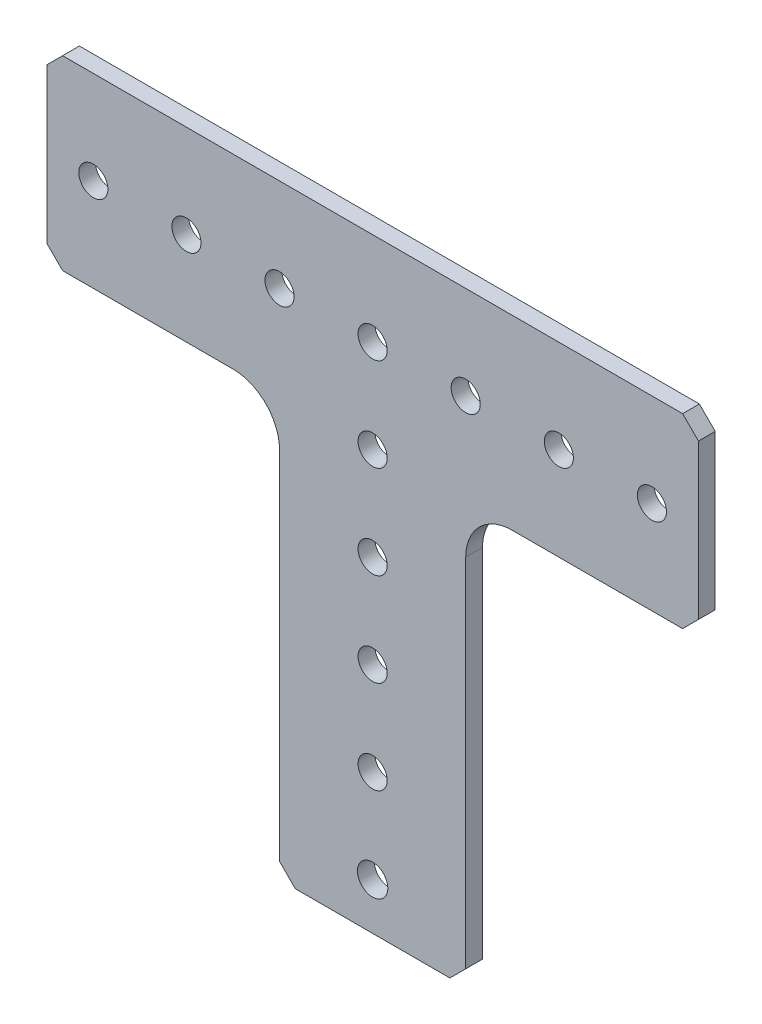
ISO-10303-21;
HEADER;
FILE_DESCRIPTION(('STEP AP214'),'2;1');
FILE_NAME('part.step','',(''),(''),'','','');
FILE_SCHEMA(('AUTOMOTIVE_DESIGN { 1 0 10303 214 1 1 1 1 }'));
ENDSEC;
DATA;
#1=APPLICATION_CONTEXT('core data for automotive mechanical design processes');
#2=APPLICATION_PROTOCOL_DEFINITION('international standard','automotive_design',2000,#1);
#3=PRODUCT_CONTEXT('',#1,'mechanical');
#4=PRODUCT('Part','Part','',(#3));
#5=PRODUCT_RELATED_PRODUCT_CATEGORY('part','',(#4));
#6=PRODUCT_DEFINITION_FORMATION('','',#4);
#7=PRODUCT_DEFINITION_CONTEXT('part definition',#1,'design');
#8=PRODUCT_DEFINITION('design','',#6,#7);
#9=PRODUCT_DEFINITION_SHAPE('','',#8);
#10=(LENGTH_UNIT() NAMED_UNIT(*) SI_UNIT(.MILLI.,.METRE.));
#11=(NAMED_UNIT(*) PLANE_ANGLE_UNIT() SI_UNIT($,.RADIAN.));
#12=(NAMED_UNIT(*) SI_UNIT($,.STERADIAN.) SOLID_ANGLE_UNIT());
#13=UNCERTAINTY_MEASURE_WITH_UNIT(LENGTH_MEASURE(1.E-05),#10,'distance_accuracy_value','');
#14=(GEOMETRIC_REPRESENTATION_CONTEXT(3) GLOBAL_UNCERTAINTY_ASSIGNED_CONTEXT((#13)) GLOBAL_UNIT_ASSIGNED_CONTEXT((#10,
#11,#12)) REPRESENTATION_CONTEXT('',''));
#15=CARTESIAN_POINT('',(0.,0.,0.));
#16=DIRECTION('',(0.,0.,1.));
#17=DIRECTION('',(1.,0.,0.));
#18=AXIS2_PLACEMENT_3D('',#15,#16,#17);
#19=CARTESIAN_POINT('',(19.05,-6.34999999999998,0.));
#20=DIRECTION('',(0.,0.,-1.));
#21=DIRECTION('',(-1.,0.,0.));
#22=AXIS2_PLACEMENT_3D('',#19,#20,#21);
#23=PLANE('',#22);
#24=CARTESIAN_POINT('',(-38.1,12.7,0.));
#25=DIRECTION('',(0.,0.,1.));
#26=DIRECTION('',(1.,0.,0.));
#27=AXIS2_PLACEMENT_3D('',#24,#25,#26);
#28=CIRCLE('',#27,1.984375);
#29=CARTESIAN_POINT('',(-36.115625,12.7,0.));
#30=VERTEX_POINT('',#29);
#31=EDGE_CURVE('E568',#30,#30,#28,.T.);
#32=ORIENTED_EDGE('',*,*,#31,.T.);
#33=EDGE_LOOP('',(#32));
#34=FACE_BOUND('',#33,.T.);
#35=CARTESIAN_POINT('',(-25.4,12.7,0.));
#36=DIRECTION('',(0.,0.,1.));
#37=DIRECTION('',(1.,0.,0.));
#38=AXIS2_PLACEMENT_3D('',#35,#36,#37);
#39=CIRCLE('',#38,1.984375);
#40=CARTESIAN_POINT('',(-23.415625,12.7,0.));
#41=VERTEX_POINT('',#40);
#42=EDGE_CURVE('E573',#41,#41,#39,.T.);
#43=ORIENTED_EDGE('',*,*,#42,.T.);
#44=EDGE_LOOP('',(#43));
#45=FACE_BOUND('',#44,.T.);
#46=CARTESIAN_POINT('',(-12.7,12.7,0.));
#47=DIRECTION('',(0.,0.,1.));
#48=DIRECTION('',(1.,0.,0.));
#49=AXIS2_PLACEMENT_3D('',#46,#47,#48);
#50=CIRCLE('',#49,1.984375);
#51=CARTESIAN_POINT('',(-10.715625,12.7,0.));
#52=VERTEX_POINT('',#51);
#53=EDGE_CURVE('E577',#52,#52,#50,.T.);
#54=ORIENTED_EDGE('',*,*,#53,.T.);
#55=EDGE_LOOP('',(#54));
#56=FACE_BOUND('',#55,.T.);
#57=CARTESIAN_POINT('',(0.,12.7,0.));
#58=DIRECTION('',(0.,0.,1.));
#59=DIRECTION('',(1.,0.,0.));
#60=AXIS2_PLACEMENT_3D('',#57,#58,#59);
#61=CIRCLE('',#60,1.984375);
#62=CARTESIAN_POINT('',(1.984375,12.7,0.));
#63=VERTEX_POINT('',#62);
#64=EDGE_CURVE('E581',#63,#63,#61,.T.);
#65=ORIENTED_EDGE('',*,*,#64,.T.);
#66=EDGE_LOOP('',(#65));
#67=FACE_BOUND('',#66,.T.);
#68=CARTESIAN_POINT('',(12.7,12.7,0.));
#69=DIRECTION('',(0.,0.,1.));
#70=DIRECTION('',(1.,0.,0.));
#71=AXIS2_PLACEMENT_3D('',#68,#69,#70);
#72=CIRCLE('',#71,1.984375);
#73=CARTESIAN_POINT('',(14.684375,12.7,0.));
#74=VERTEX_POINT('',#73);
#75=EDGE_CURVE('E585',#74,#74,#72,.T.);
#76=ORIENTED_EDGE('',*,*,#75,.T.);
#77=EDGE_LOOP('',(#76));
#78=FACE_BOUND('',#77,.T.);
#79=CARTESIAN_POINT('',(25.4,12.7,0.));
#80=DIRECTION('',(0.,0.,1.));
#81=DIRECTION('',(1.,0.,0.));
#82=AXIS2_PLACEMENT_3D('',#79,#80,#81);
#83=CIRCLE('',#82,1.984375);
#84=CARTESIAN_POINT('',(27.384375,12.7,0.));
#85=VERTEX_POINT('',#84);
#86=EDGE_CURVE('E589',#85,#85,#83,.T.);
#87=ORIENTED_EDGE('',*,*,#86,.T.);
#88=EDGE_LOOP('',(#87));
#89=FACE_BOUND('',#88,.T.);
#90=CARTESIAN_POINT('',(38.1,12.7,0.));
#91=DIRECTION('',(0.,0.,1.));
#92=DIRECTION('',(1.,0.,0.));
#93=AXIS2_PLACEMENT_3D('',#90,#91,#92);
#94=CIRCLE('',#93,1.984375);
#95=CARTESIAN_POINT('',(40.084375,12.7,0.));
#96=VERTEX_POINT('',#95);
#97=EDGE_CURVE('E593',#96,#96,#94,.T.);
#98=ORIENTED_EDGE('',*,*,#97,.T.);
#99=EDGE_LOOP('',(#98));
#100=FACE_BOUND('',#99,.T.);
#101=CARTESIAN_POINT('',(0.,0.,0.));
#102=DIRECTION('',(0.,0.,1.));
#103=DIRECTION('',(1.,0.,0.));
#104=AXIS2_PLACEMENT_3D('',#101,#102,#103);
#105=CIRCLE('',#104,1.984375);
#106=CARTESIAN_POINT('',(1.984375,0.,0.));
#107=VERTEX_POINT('',#106);
#108=EDGE_CURVE('E597',#107,#107,#105,.T.);
#109=ORIENTED_EDGE('',*,*,#108,.T.);
#110=EDGE_LOOP('',(#109));
#111=FACE_BOUND('',#110,.T.);
#112=CARTESIAN_POINT('',(0.,-12.7,0.));
#113=DIRECTION('',(0.,0.,1.));
#114=DIRECTION('',(1.,0.,0.));
#115=AXIS2_PLACEMENT_3D('',#112,#113,#114);
#116=CIRCLE('',#115,1.984375);
#117=CARTESIAN_POINT('',(1.984375,-12.7,0.));
#118=VERTEX_POINT('',#117);
#119=EDGE_CURVE('E601',#118,#118,#116,.T.);
#120=ORIENTED_EDGE('',*,*,#119,.T.);
#121=EDGE_LOOP('',(#120));
#122=FACE_BOUND('',#121,.T.);
#123=CARTESIAN_POINT('',(0.,-25.4,0.));
#124=DIRECTION('',(0.,0.,1.));
#125=DIRECTION('',(1.,0.,0.));
#126=AXIS2_PLACEMENT_3D('',#123,#124,#125);
#127=CIRCLE('',#126,1.984375);
#128=CARTESIAN_POINT('',(1.984375,-25.4,0.));
#129=VERTEX_POINT('',#128);
#130=EDGE_CURVE('E605',#129,#129,#127,.T.);
#131=ORIENTED_EDGE('',*,*,#130,.T.);
#132=EDGE_LOOP('',(#131));
#133=FACE_BOUND('',#132,.T.);
#134=DIRECTION('',(0.707106781186547,0.707106781186548,0.));
#135=VECTOR('',#134,1.);
#136=CARTESIAN_POINT('',(10.541,-57.15,0.));
#137=LINE('',#136,#135);
#138=CARTESIAN_POINT('',(10.541,-57.15,0.));
#139=VERTEX_POINT('',#138);
#140=CARTESIAN_POINT('',(12.7,-54.991,0.));
#141=VERTEX_POINT('',#140);
#142=EDGE_CURVE('E224',#139,#141,#137,.T.);
#143=ORIENTED_EDGE('',*,*,#142,.F.);
#144=DIRECTION('',(1.,0.,0.));
#145=VECTOR('',#144,1.);
#146=CARTESIAN_POINT('',(-10.541,-57.15,0.));
#147=LINE('',#146,#145);
#148=CARTESIAN_POINT('',(-10.541,-57.15,0.));
#149=VERTEX_POINT('',#148);
#150=EDGE_CURVE('E169',#149,#139,#147,.T.);
#151=ORIENTED_EDGE('',*,*,#150,.F.);
#152=DIRECTION('',(0.70710678118655,-0.707106781186545,0.));
#153=VECTOR('',#152,1.);
#154=CARTESIAN_POINT('',(-12.7,-54.991,0.));
#155=LINE('',#154,#153);
#156=CARTESIAN_POINT('',(-12.7,-54.991,0.));
#157=VERTEX_POINT('',#156);
#158=EDGE_CURVE('E154',#157,#149,#155,.T.);
#159=ORIENTED_EDGE('',*,*,#158,.F.);
#160=DIRECTION('',(0.,-1.,0.));
#161=VECTOR('',#160,1.);
#162=CARTESIAN_POINT('',(-12.7,-6.34999999999998,0.));
#163=LINE('',#162,#161);
#164=CARTESIAN_POINT('',(-12.7,-6.34999999999999,0.));
#165=VERTEX_POINT('',#164);
#166=EDGE_CURVE('E167',#165,#157,#163,.T.);
#167=ORIENTED_EDGE('',*,*,#166,.F.);
#168=CARTESIAN_POINT('',(-19.05,-6.34999999999999,0.));
#169=DIRECTION('',(0.,0.,-1.));
#170=DIRECTION('',(-1.,0.,0.));
#171=AXIS2_PLACEMENT_3D('',#168,#169,#170);
#172=CIRCLE('',#171,6.35);
#173=CARTESIAN_POINT('',(-19.05,0.,0.));
#174=VERTEX_POINT('',#173);
#175=EDGE_CURVE('E172',#174,#165,#172,.T.);
#176=ORIENTED_EDGE('',*,*,#175,.F.);
#177=DIRECTION('',(1.,0.,0.));
#178=VECTOR('',#177,1.);
#179=CARTESIAN_POINT('',(-42.291,0.,0.));
#180=LINE('',#179,#178);
#181=CARTESIAN_POINT('',(-42.291,0.,0.));
#182=VERTEX_POINT('',#181);
#183=EDGE_CURVE('E174',#182,#174,#180,.T.);
#184=ORIENTED_EDGE('',*,*,#183,.F.);
#185=DIRECTION('',(0.70710678118655,-0.707106781186545,0.));
#186=VECTOR('',#185,1.);
#187=CARTESIAN_POINT('',(-44.45,2.15899999999999,0.));
#188=LINE('',#187,#186);
#189=CARTESIAN_POINT('',(-44.45,2.15899999999999,0.));
#190=VERTEX_POINT('',#189);
#191=EDGE_CURVE('E362',#190,#182,#188,.T.);
#192=ORIENTED_EDGE('',*,*,#191,.F.);
#193=DIRECTION('',(0.,-1.,0.));
#194=VECTOR('',#193,1.);
#195=CARTESIAN_POINT('',(-44.45,23.241,0.));
#196=LINE('',#195,#194);
#197=CARTESIAN_POINT('',(-44.45,23.241,0.));
#198=VERTEX_POINT('',#197);
#199=EDGE_CURVE('E359',#198,#190,#196,.T.);
#200=ORIENTED_EDGE('',*,*,#199,.F.);
#201=DIRECTION('',(-0.707106781186552,-0.707106781186543,0.));
#202=VECTOR('',#201,1.);
#203=CARTESIAN_POINT('',(-42.291,25.4,0.));
#204=LINE('',#203,#202);
#205=CARTESIAN_POINT('',(-42.291,25.4,0.));
#206=VERTEX_POINT('',#205);
#207=EDGE_CURVE('E356',#206,#198,#204,.T.);
#208=ORIENTED_EDGE('',*,*,#207,.F.);
#209=DIRECTION('',(-1.,0.,0.));
#210=VECTOR('',#209,1.);
#211=CARTESIAN_POINT('',(42.291,25.4,0.));
#212=LINE('',#211,#210);
#213=CARTESIAN_POINT('',(42.291,25.4,0.));
#214=VERTEX_POINT('',#213);
#215=EDGE_CURVE('E353',#214,#206,#212,.T.);
#216=ORIENTED_EDGE('',*,*,#215,.F.);
#217=DIRECTION('',(-0.707106781186549,0.707106781186546,0.));
#218=VECTOR('',#217,1.);
#219=CARTESIAN_POINT('',(44.45,23.241,0.));
#220=LINE('',#219,#218);
#221=CARTESIAN_POINT('',(44.45,23.241,0.));
#222=VERTEX_POINT('',#221);
#223=EDGE_CURVE('E350',#222,#214,#220,.T.);
#224=ORIENTED_EDGE('',*,*,#223,.F.);
#225=DIRECTION('',(0.,1.,0.));
#226=VECTOR('',#225,1.);
#227=CARTESIAN_POINT('',(44.45,2.15900000000002,0.));
#228=LINE('',#227,#226);
#229=CARTESIAN_POINT('',(44.45,2.15900000000002,0.));
#230=VERTEX_POINT('',#229);
#231=EDGE_CURVE('E347',#230,#222,#228,.T.);
#232=ORIENTED_EDGE('',*,*,#231,.F.);
#233=DIRECTION('',(0.707106781186546,0.707106781186548,0.));
#234=VECTOR('',#233,1.);
#235=CARTESIAN_POINT('',(42.291,0.,0.));
#236=LINE('',#235,#234);
#237=CARTESIAN_POINT('',(42.291,0.,0.));
#238=VERTEX_POINT('',#237);
#239=EDGE_CURVE('E344',#238,#230,#236,.T.);
#240=ORIENTED_EDGE('',*,*,#239,.F.);
#241=DIRECTION('',(1.,0.,0.));
#242=VECTOR('',#241,1.);
#243=CARTESIAN_POINT('',(19.05,0.,0.));
#244=LINE('',#243,#242);
#245=CARTESIAN_POINT('',(19.05,0.,0.));
#246=VERTEX_POINT('',#245);
#247=EDGE_CURVE('E341',#246,#238,#244,.T.);
#248=ORIENTED_EDGE('',*,*,#247,.F.);
#249=CARTESIAN_POINT('',(19.05,-6.34999999999998,0.));
#250=DIRECTION('',(0.,0.,-1.));
#251=DIRECTION('',(-1.,0.,0.));
#252=AXIS2_PLACEMENT_3D('',#249,#250,#251);
#253=CIRCLE('',#252,6.35);
#254=CARTESIAN_POINT('',(12.7,-6.34999999999998,0.));
#255=VERTEX_POINT('',#254);
#256=EDGE_CURVE('E338',#255,#246,#253,.T.);
#257=ORIENTED_EDGE('',*,*,#256,.F.);
#258=DIRECTION('',(0.,1.,0.));
#259=VECTOR('',#258,1.);
#260=CARTESIAN_POINT('',(12.7,-54.991,0.));
#261=LINE('',#260,#259);
#262=EDGE_CURVE('E336',#141,#255,#261,.T.);
#263=ORIENTED_EDGE('',*,*,#262,.F.);
#264=EDGE_LOOP('',(#143,#151,#159,#167,#176,#184,#192,#200,#208,#216,#224,#232,#240,#248,#257,#263));
#265=FACE_BOUND('',#264,.T.);
#266=CARTESIAN_POINT('',(0.,-50.8,0.));
#267=DIRECTION('',(0.,0.,1.));
#268=DIRECTION('',(-1.,0.,0.));
#269=AXIS2_PLACEMENT_3D('',#266,#267,#268);
#270=CIRCLE('',#269,2.0701);
#271=CARTESIAN_POINT('',(-2.07009999999999,-50.8,0.));
#272=VERTEX_POINT('',#271);
#273=EDGE_CURVE('E183',#272,#272,#270,.T.);
#274=ORIENTED_EDGE('',*,*,#273,.T.);
#275=EDGE_LOOP('',(#274));
#276=FACE_BOUND('',#275,.T.);
#277=CARTESIAN_POINT('',(0.,-38.1,0.));
#278=DIRECTION('',(0.,0.,1.));
#279=DIRECTION('',(1.,0.,0.));
#280=AXIS2_PLACEMENT_3D('',#277,#278,#279);
#281=CIRCLE('',#280,1.984375);
#282=CARTESIAN_POINT('',(1.984375,-38.1,0.));
#283=VERTEX_POINT('',#282);
#284=EDGE_CURVE('E328',#283,#283,#281,.T.);
#285=ORIENTED_EDGE('',*,*,#284,.T.);
#286=EDGE_LOOP('',(#285));
#287=FACE_BOUND('',#286,.T.);
#288=ADVANCED_FACE('F33',(#34,#45,#56,#67,#78,#89,#100,#111,#122,#133,#265,#276,#287),#23,.T.);
#289=CARTESIAN_POINT('',(10.541,-57.15,0.));
#290=DIRECTION('',(0.707106781186548,-0.707106781186547,0.));
#291=DIRECTION('',(0.707106781186547,0.707106781186548,0.));
#292=AXIS2_PLACEMENT_3D('',#289,#290,#291);
#293=PLANE('',#292);
#294=DIRECTION('',(0.707106781186547,0.707106781186548,0.));
#295=VECTOR('',#294,1.);
#296=CARTESIAN_POINT('',(10.541,-57.15,2.286));
#297=LINE('',#296,#295);
#298=CARTESIAN_POINT('',(10.541,-57.15,2.286));
#299=VERTEX_POINT('',#298);
#300=CARTESIAN_POINT('',(12.7,-54.991,2.286));
#301=VERTEX_POINT('',#300);
#302=EDGE_CURVE('E179',#299,#301,#297,.T.);
#303=ORIENTED_EDGE('',*,*,#302,.F.);
#304=DIRECTION('',(0.,0.,1.));
#305=VECTOR('',#304,1.);
#306=CARTESIAN_POINT('',(10.541,-57.15,0.));
#307=LINE('',#306,#305);
#308=EDGE_CURVE('E11',#139,#299,#307,.T.);
#309=ORIENTED_EDGE('',*,*,#308,.F.);
#310=ORIENTED_EDGE('',*,*,#142,.T.);
#311=DIRECTION('',(0.,0.,1.));
#312=VECTOR('',#311,1.);
#313=CARTESIAN_POINT('',(12.7,-54.991,0.));
#314=LINE('',#313,#312);
#315=EDGE_CURVE('E37',#141,#301,#314,.T.);
#316=ORIENTED_EDGE('',*,*,#315,.T.);
#317=EDGE_LOOP('',(#303,#309,#310,#316));
#318=FACE_BOUND('',#317,.T.);
#319=ADVANCED_FACE('F35',(#318),#293,.T.);
#320=CARTESIAN_POINT('',(-10.541,-57.15,0.));
#321=DIRECTION('',(0.,-1.,0.));
#322=DIRECTION('',(0.,0.,-1.));
#323=AXIS2_PLACEMENT_3D('',#320,#321,#322);
#324=PLANE('',#323);
#325=DIRECTION('',(1.,0.,0.));
#326=VECTOR('',#325,1.);
#327=CARTESIAN_POINT('',(-10.541,-57.15,2.286));
#328=LINE('',#327,#326);
#329=CARTESIAN_POINT('',(-10.541,-57.15,2.286));
#330=VERTEX_POINT('',#329);
#331=EDGE_CURVE('E222',#330,#299,#328,.T.);
#332=ORIENTED_EDGE('',*,*,#331,.F.);
#333=DIRECTION('',(0.,0.,1.));
#334=VECTOR('',#333,1.);
#335=CARTESIAN_POINT('',(-10.541,-57.15,0.));
#336=LINE('',#335,#334);
#337=EDGE_CURVE('E43',#149,#330,#336,.T.);
#338=ORIENTED_EDGE('',*,*,#337,.F.);
#339=ORIENTED_EDGE('',*,*,#150,.T.);
#340=ORIENTED_EDGE('',*,*,#308,.T.);
#341=EDGE_LOOP('',(#332,#338,#339,#340));
#342=FACE_BOUND('',#341,.T.);
#343=ADVANCED_FACE('F252',(#342),#324,.T.);
#344=CARTESIAN_POINT('',(-12.7,-54.991,0.));
#345=DIRECTION('',(-0.707106781186545,-0.70710678118655,0.));
#346=DIRECTION('',(0.70710678118655,-0.707106781186545,0.));
#347=AXIS2_PLACEMENT_3D('',#344,#345,#346);
#348=PLANE('',#347);
#349=DIRECTION('',(0.70710678118655,-0.707106781186545,0.));
#350=VECTOR('',#349,1.);
#351=CARTESIAN_POINT('',(-12.7,-54.991,2.286));
#352=LINE('',#351,#350);
#353=CARTESIAN_POINT('',(-12.7,-54.991,2.286));
#354=VERTEX_POINT('',#353);
#355=EDGE_CURVE('E156',#354,#330,#352,.T.);
#356=ORIENTED_EDGE('',*,*,#355,.F.);
#357=DIRECTION('',(0.,0.,1.));
#358=VECTOR('',#357,1.);
#359=CARTESIAN_POINT('',(-12.7,-54.991,0.));
#360=LINE('',#359,#358);
#361=EDGE_CURVE('E151',#157,#354,#360,.T.);
#362=ORIENTED_EDGE('',*,*,#361,.F.);
#363=ORIENTED_EDGE('',*,*,#158,.T.);
#364=ORIENTED_EDGE('',*,*,#337,.T.);
#365=EDGE_LOOP('',(#356,#362,#363,#364));
#366=FACE_BOUND('',#365,.T.);
#367=ADVANCED_FACE('F153',(#366),#348,.T.);
#368=CARTESIAN_POINT('',(-12.7,-6.34999999999998,0.));
#369=DIRECTION('',(-1.,0.,0.));
#370=DIRECTION('',(0.,-1.,0.));
#371=AXIS2_PLACEMENT_3D('',#368,#369,#370);
#372=PLANE('',#371);
#373=DIRECTION('',(0.,-1.,0.));
#374=VECTOR('',#373,1.);
#375=CARTESIAN_POINT('',(-12.7,-6.34999999999998,2.286));
#376=LINE('',#375,#374);
#377=CARTESIAN_POINT('',(-12.7,-6.34999999999999,2.286));
#378=VERTEX_POINT('',#377);
#379=EDGE_CURVE('E219',#378,#354,#376,.T.);
#380=ORIENTED_EDGE('',*,*,#379,.F.);
#381=DIRECTION('',(0.,0.,1.));
#382=VECTOR('',#381,1.);
#383=CARTESIAN_POINT('',(-12.7,-6.34999999999999,0.));
#384=LINE('',#383,#382);
#385=EDGE_CURVE('E161',#165,#378,#384,.T.);
#386=ORIENTED_EDGE('',*,*,#385,.F.);
#387=ORIENTED_EDGE('',*,*,#166,.T.);
#388=ORIENTED_EDGE('',*,*,#361,.T.);
#389=EDGE_LOOP('',(#380,#386,#387,#388));
#390=FACE_BOUND('',#389,.T.);
#391=ADVANCED_FACE('F171',(#390),#372,.T.);
#392=CARTESIAN_POINT('',(-19.05,-6.34999999999999,0.));
#393=DIRECTION('',(0.,0.,1.));
#394=DIRECTION('',(1.,0.,0.));
#395=AXIS2_PLACEMENT_3D('',#392,#393,#394);
#396=CYLINDRICAL_SURFACE('',#395,6.35);
#397=CARTESIAN_POINT('',(-19.05,-6.34999999999999,2.286));
#398=DIRECTION('',(0.,0.,-1.));
#399=DIRECTION('',(-1.,0.,0.));
#400=AXIS2_PLACEMENT_3D('',#397,#398,#399);
#401=CIRCLE('',#400,6.35);
#402=CARTESIAN_POINT('',(-19.05,0.,2.286));
#403=VERTEX_POINT('',#402);
#404=EDGE_CURVE('E216',#403,#378,#401,.T.);
#405=ORIENTED_EDGE('',*,*,#404,.F.);
#406=DIRECTION('',(0.,0.,1.));
#407=VECTOR('',#406,1.);
#408=CARTESIAN_POINT('',(-19.05,0.,0.));
#409=LINE('',#408,#407);
#410=EDGE_CURVE('E228',#174,#403,#409,.T.);
#411=ORIENTED_EDGE('',*,*,#410,.F.);
#412=ORIENTED_EDGE('',*,*,#175,.T.);
#413=ORIENTED_EDGE('',*,*,#385,.T.);
#414=EDGE_LOOP('',(#405,#411,#412,#413));
#415=FACE_BOUND('',#414,.T.);
#416=ADVANCED_FACE('F405',(#415),#396,.F.);
#417=CARTESIAN_POINT('',(-42.291,0.,0.));
#418=DIRECTION('',(0.,-1.,0.));
#419=DIRECTION('',(1.,0.,0.));
#420=AXIS2_PLACEMENT_3D('',#417,#418,#419);
#421=PLANE('',#420);
#422=DIRECTION('',(1.,0.,0.));
#423=VECTOR('',#422,1.);
#424=CARTESIAN_POINT('',(-42.291,0.,2.286));
#425=LINE('',#424,#423);
#426=CARTESIAN_POINT('',(-42.291,0.,2.286));
#427=VERTEX_POINT('',#426);
#428=EDGE_CURVE('E213',#427,#403,#425,.T.);
#429=ORIENTED_EDGE('',*,*,#428,.F.);
#430=DIRECTION('',(0.,0.,1.));
#431=VECTOR('',#430,1.);
#432=CARTESIAN_POINT('',(-42.291,0.,0.));
#433=LINE('',#432,#431);
#434=EDGE_CURVE('E230',#182,#427,#433,.T.);
#435=ORIENTED_EDGE('',*,*,#434,.F.);
#436=ORIENTED_EDGE('',*,*,#183,.T.);
#437=ORIENTED_EDGE('',*,*,#410,.T.);
#438=EDGE_LOOP('',(#429,#435,#436,#437));
#439=FACE_BOUND('',#438,.T.);
#440=ADVANCED_FACE('F368',(#439),#421,.T.);
#441=CARTESIAN_POINT('',(-44.45,2.15899999999999,0.));
#442=DIRECTION('',(-0.707106781186545,-0.70710678118655,0.));
#443=DIRECTION('',(0.70710678118655,-0.707106781186545,0.));
#444=AXIS2_PLACEMENT_3D('',#441,#442,#443);
#445=PLANE('',#444);
#446=DIRECTION('',(0.70710678118655,-0.707106781186545,0.));
#447=VECTOR('',#446,1.);
#448=CARTESIAN_POINT('',(-44.45,2.15899999999999,2.286));
#449=LINE('',#448,#447);
#450=CARTESIAN_POINT('',(-44.45,2.15899999999999,2.286));
#451=VERTEX_POINT('',#450);
#452=EDGE_CURVE('E210',#451,#427,#449,.T.);
#453=ORIENTED_EDGE('',*,*,#452,.F.);
#454=DIRECTION('',(0.,0.,1.));
#455=VECTOR('',#454,1.);
#456=CARTESIAN_POINT('',(-44.45,2.15899999999999,0.));
#457=LINE('',#456,#455);
#458=EDGE_CURVE('E232',#190,#451,#457,.T.);
#459=ORIENTED_EDGE('',*,*,#458,.F.);
#460=ORIENTED_EDGE('',*,*,#191,.T.);
#461=ORIENTED_EDGE('',*,*,#434,.T.);
#462=EDGE_LOOP('',(#453,#459,#460,#461));
#463=FACE_BOUND('',#462,.T.);
#464=ADVANCED_FACE('F374',(#463),#445,.T.);
#465=CARTESIAN_POINT('',(-44.45,23.241,0.));
#466=DIRECTION('',(-1.,0.,0.));
#467=DIRECTION('',(0.,-1.,0.));
#468=AXIS2_PLACEMENT_3D('',#465,#466,#467);
#469=PLANE('',#468);
#470=DIRECTION('',(0.,-1.,0.));
#471=VECTOR('',#470,1.);
#472=CARTESIAN_POINT('',(-44.45,23.241,2.286));
#473=LINE('',#472,#471);
#474=CARTESIAN_POINT('',(-44.45,23.241,2.286));
#475=VERTEX_POINT('',#474);
#476=EDGE_CURVE('E207',#475,#451,#473,.T.);
#477=ORIENTED_EDGE('',*,*,#476,.F.);
#478=DIRECTION('',(0.,0.,1.));
#479=VECTOR('',#478,1.);
#480=CARTESIAN_POINT('',(-44.45,23.241,0.));
#481=LINE('',#480,#479);
#482=EDGE_CURVE('E234',#198,#475,#481,.T.);
#483=ORIENTED_EDGE('',*,*,#482,.F.);
#484=ORIENTED_EDGE('',*,*,#199,.T.);
#485=ORIENTED_EDGE('',*,*,#458,.T.);
#486=EDGE_LOOP('',(#477,#483,#484,#485));
#487=FACE_BOUND('',#486,.T.);
#488=ADVANCED_FACE('F377',(#487),#469,.T.);
#489=CARTESIAN_POINT('',(-42.291,25.4,0.));
#490=DIRECTION('',(-0.707106781186543,0.707106781186552,0.));
#491=DIRECTION('',(-0.707106781186552,-0.707106781186543,0.));
#492=AXIS2_PLACEMENT_3D('',#489,#490,#491);
#493=PLANE('',#492);
#494=DIRECTION('',(-0.707106781186552,-0.707106781186543,0.));
#495=VECTOR('',#494,1.);
#496=CARTESIAN_POINT('',(-42.291,25.4,2.286));
#497=LINE('',#496,#495);
#498=CARTESIAN_POINT('',(-42.291,25.4,2.286));
#499=VERTEX_POINT('',#498);
#500=EDGE_CURVE('E204',#499,#475,#497,.T.);
#501=ORIENTED_EDGE('',*,*,#500,.F.);
#502=DIRECTION('',(0.,0.,1.));
#503=VECTOR('',#502,1.);
#504=CARTESIAN_POINT('',(-42.291,25.4,0.));
#505=LINE('',#504,#503);
#506=EDGE_CURVE('E236',#206,#499,#505,.T.);
#507=ORIENTED_EDGE('',*,*,#506,.F.);
#508=ORIENTED_EDGE('',*,*,#207,.T.);
#509=ORIENTED_EDGE('',*,*,#482,.T.);
#510=EDGE_LOOP('',(#501,#507,#508,#509));
#511=FACE_BOUND('',#510,.T.);
#512=ADVANCED_FACE('F382',(#511),#493,.T.);
#513=CARTESIAN_POINT('',(42.291,25.4,0.));
#514=DIRECTION('',(0.,1.,0.));
#515=DIRECTION('',(-1.,0.,0.));
#516=AXIS2_PLACEMENT_3D('',#513,#514,#515);
#517=PLANE('',#516);
#518=DIRECTION('',(-1.,0.,0.));
#519=VECTOR('',#518,1.);
#520=CARTESIAN_POINT('',(42.291,25.4,2.286));
#521=LINE('',#520,#519);
#522=CARTESIAN_POINT('',(42.291,25.4,2.286));
#523=VERTEX_POINT('',#522);
#524=EDGE_CURVE('E201',#523,#499,#521,.T.);
#525=ORIENTED_EDGE('',*,*,#524,.F.);
#526=DIRECTION('',(0.,0.,1.));
#527=VECTOR('',#526,1.);
#528=CARTESIAN_POINT('',(42.291,25.4,0.));
#529=LINE('',#528,#527);
#530=EDGE_CURVE('E238',#214,#523,#529,.T.);
#531=ORIENTED_EDGE('',*,*,#530,.F.);
#532=ORIENTED_EDGE('',*,*,#215,.T.);
#533=ORIENTED_EDGE('',*,*,#506,.T.);
#534=EDGE_LOOP('',(#525,#531,#532,#533));
#535=FACE_BOUND('',#534,.T.);
#536=ADVANCED_FACE('F385',(#535),#517,.T.);
#537=CARTESIAN_POINT('',(44.45,23.241,0.));
#538=DIRECTION('',(0.707106781186546,0.707106781186549,0.));
#539=DIRECTION('',(-0.707106781186549,0.707106781186546,0.));
#540=AXIS2_PLACEMENT_3D('',#537,#538,#539);
#541=PLANE('',#540);
#542=DIRECTION('',(-0.707106781186549,0.707106781186546,0.));
#543=VECTOR('',#542,1.);
#544=CARTESIAN_POINT('',(44.45,23.241,2.286));
#545=LINE('',#544,#543);
#546=CARTESIAN_POINT('',(44.45,23.241,2.286));
#547=VERTEX_POINT('',#546);
#548=EDGE_CURVE('E198',#547,#523,#545,.T.);
#549=ORIENTED_EDGE('',*,*,#548,.F.);
#550=DIRECTION('',(0.,0.,1.));
#551=VECTOR('',#550,1.);
#552=CARTESIAN_POINT('',(44.45,23.241,0.));
#553=LINE('',#552,#551);
#554=EDGE_CURVE('E240',#222,#547,#553,.T.);
#555=ORIENTED_EDGE('',*,*,#554,.F.);
#556=ORIENTED_EDGE('',*,*,#223,.T.);
#557=ORIENTED_EDGE('',*,*,#530,.T.);
#558=EDGE_LOOP('',(#549,#555,#556,#557));
#559=FACE_BOUND('',#558,.T.);
#560=ADVANCED_FACE('F390',(#559),#541,.T.);
#561=CARTESIAN_POINT('',(44.45,2.15900000000002,0.));
#562=DIRECTION('',(1.,0.,0.));
#563=DIRECTION('',(0.,1.,0.));
#564=AXIS2_PLACEMENT_3D('',#561,#562,#563);
#565=PLANE('',#564);
#566=DIRECTION('',(0.,1.,0.));
#567=VECTOR('',#566,1.);
#568=CARTESIAN_POINT('',(44.45,2.15900000000002,2.286));
#569=LINE('',#568,#567);
#570=CARTESIAN_POINT('',(44.45,2.15900000000002,2.286));
#571=VERTEX_POINT('',#570);
#572=EDGE_CURVE('E195',#571,#547,#569,.T.);
#573=ORIENTED_EDGE('',*,*,#572,.F.);
#574=DIRECTION('',(0.,0.,1.));
#575=VECTOR('',#574,1.);
#576=CARTESIAN_POINT('',(44.45,2.15900000000002,0.));
#577=LINE('',#576,#575);
#578=EDGE_CURVE('E242',#230,#571,#577,.T.);
#579=ORIENTED_EDGE('',*,*,#578,.F.);
#580=ORIENTED_EDGE('',*,*,#231,.T.);
#581=ORIENTED_EDGE('',*,*,#554,.T.);
#582=EDGE_LOOP('',(#573,#579,#580,#581));
#583=FACE_BOUND('',#582,.T.);
#584=ADVANCED_FACE('F393',(#583),#565,.T.);
#585=CARTESIAN_POINT('',(42.291,0.,0.));
#586=DIRECTION('',(0.707106781186549,-0.707106781186547,0.));
#587=DIRECTION('',(0.707106781186547,0.707106781186549,0.));
#588=AXIS2_PLACEMENT_3D('',#585,#586,#587);
#589=PLANE('',#588);
#590=DIRECTION('',(0.707106781186546,0.707106781186548,0.));
#591=VECTOR('',#590,1.);
#592=CARTESIAN_POINT('',(42.291,0.,2.286));
#593=LINE('',#592,#591);
#594=CARTESIAN_POINT('',(42.291,0.,2.286));
#595=VERTEX_POINT('',#594);
#596=EDGE_CURVE('E192',#595,#571,#593,.T.);
#597=ORIENTED_EDGE('',*,*,#596,.F.);
#598=DIRECTION('',(0.,0.,1.));
#599=VECTOR('',#598,1.);
#600=CARTESIAN_POINT('',(42.291,0.,0.));
#601=LINE('',#600,#599);
#602=EDGE_CURVE('E244',#238,#595,#601,.T.);
#603=ORIENTED_EDGE('',*,*,#602,.F.);
#604=ORIENTED_EDGE('',*,*,#239,.T.);
#605=ORIENTED_EDGE('',*,*,#578,.T.);
#606=EDGE_LOOP('',(#597,#603,#604,#605));
#607=FACE_BOUND('',#606,.T.);
#608=ADVANCED_FACE('F398',(#607),#589,.T.);
#609=CARTESIAN_POINT('',(19.05,0.,0.));
#610=DIRECTION('',(0.,-1.,0.));
#611=DIRECTION('',(1.,0.,0.));
#612=AXIS2_PLACEMENT_3D('',#609,#610,#611);
#613=PLANE('',#612);
#614=DIRECTION('',(1.,0.,0.));
#615=VECTOR('',#614,1.);
#616=CARTESIAN_POINT('',(19.05,0.,2.286));
#617=LINE('',#616,#615);
#618=CARTESIAN_POINT('',(19.05,0.,2.286));
#619=VERTEX_POINT('',#618);
#620=EDGE_CURVE('E189',#619,#595,#617,.T.);
#621=ORIENTED_EDGE('',*,*,#620,.F.);
#622=DIRECTION('',(0.,0.,1.));
#623=VECTOR('',#622,1.);
#624=CARTESIAN_POINT('',(19.05,0.,0.));
#625=LINE('',#624,#623);
#626=EDGE_CURVE('E246',#246,#619,#625,.T.);
#627=ORIENTED_EDGE('',*,*,#626,.F.);
#628=ORIENTED_EDGE('',*,*,#247,.T.);
#629=ORIENTED_EDGE('',*,*,#602,.T.);
#630=EDGE_LOOP('',(#621,#627,#628,#629));
#631=FACE_BOUND('',#630,.T.);
#632=ADVANCED_FACE('F401',(#631),#613,.T.);
#633=CARTESIAN_POINT('',(19.05,-6.34999999999998,0.));
#634=DIRECTION('',(0.,0.,1.));
#635=DIRECTION('',(1.,0.,0.));
#636=AXIS2_PLACEMENT_3D('',#633,#634,#635);
#637=CYLINDRICAL_SURFACE('',#636,6.35);
#638=CARTESIAN_POINT('',(19.05,-6.34999999999998,2.286));
#639=DIRECTION('',(0.,0.,-1.));
#640=DIRECTION('',(-1.,0.,0.));
#641=AXIS2_PLACEMENT_3D('',#638,#639,#640);
#642=CIRCLE('',#641,6.35);
#643=CARTESIAN_POINT('',(12.7,-6.34999999999998,2.286));
#644=VERTEX_POINT('',#643);
#645=EDGE_CURVE('E186',#644,#619,#642,.T.);
#646=ORIENTED_EDGE('',*,*,#645,.F.);
#647=DIRECTION('',(0.,0.,1.));
#648=VECTOR('',#647,1.);
#649=CARTESIAN_POINT('',(12.7,-6.34999999999998,0.));
#650=LINE('',#649,#648);
#651=EDGE_CURVE('E247',#255,#644,#650,.T.);
#652=ORIENTED_EDGE('',*,*,#651,.F.);
#653=ORIENTED_EDGE('',*,*,#256,.T.);
#654=ORIENTED_EDGE('',*,*,#626,.T.);
#655=EDGE_LOOP('',(#646,#652,#653,#654));
#656=FACE_BOUND('',#655,.T.);
#657=ADVANCED_FACE('F279',(#656),#637,.F.);
#658=CARTESIAN_POINT('',(12.7,-54.991,0.));
#659=DIRECTION('',(1.,0.,0.));
#660=DIRECTION('',(0.,1.,0.));
#661=AXIS2_PLACEMENT_3D('',#658,#659,#660);
#662=PLANE('',#661);
#663=DIRECTION('',(0.,1.,0.));
#664=VECTOR('',#663,1.);
#665=CARTESIAN_POINT('',(12.7,-54.991,2.286));
#666=LINE('',#665,#664);
#667=EDGE_CURVE('E182',#301,#644,#666,.T.);
#668=ORIENTED_EDGE('',*,*,#667,.F.);
#669=ORIENTED_EDGE('',*,*,#315,.F.);
#670=ORIENTED_EDGE('',*,*,#262,.T.);
#671=ORIENTED_EDGE('',*,*,#651,.T.);
#672=EDGE_LOOP('',(#668,#669,#670,#671));
#673=FACE_BOUND('',#672,.T.);
#674=ADVANCED_FACE('F249',(#673),#662,.T.);
#675=CARTESIAN_POINT('',(19.05,-6.34999999999998,2.286));
#676=DIRECTION('',(0.,0.,-1.));
#677=DIRECTION('',(-1.,0.,0.));
#678=AXIS2_PLACEMENT_3D('',#675,#676,#677);
#679=PLANE('',#678);
#680=CARTESIAN_POINT('',(-38.1,12.7,2.286));
#681=DIRECTION('',(0.,0.,1.));
#682=DIRECTION('',(1.,0.,0.));
#683=AXIS2_PLACEMENT_3D('',#680,#681,#682);
#684=CIRCLE('',#683,1.98437499999999);
#685=CARTESIAN_POINT('',(-36.115625,12.7,2.286));
#686=VERTEX_POINT('',#685);
#687=EDGE_CURVE('E283',#686,#686,#684,.T.);
#688=ORIENTED_EDGE('',*,*,#687,.F.);
#689=EDGE_LOOP('',(#688));
#690=FACE_BOUND('',#689,.T.);
#691=CARTESIAN_POINT('',(-25.4,12.7,2.286));
#692=DIRECTION('',(0.,0.,1.));
#693=DIRECTION('',(1.,0.,0.));
#694=AXIS2_PLACEMENT_3D('',#691,#692,#693);
#695=CIRCLE('',#694,1.98437499999999);
#696=CARTESIAN_POINT('',(-23.415625,12.7,2.286));
#697=VERTEX_POINT('',#696);
#698=EDGE_CURVE('E287',#697,#697,#695,.T.);
#699=ORIENTED_EDGE('',*,*,#698,.F.);
#700=EDGE_LOOP('',(#699));
#701=FACE_BOUND('',#700,.T.);
#702=CARTESIAN_POINT('',(-12.7,12.7,2.286));
#703=DIRECTION('',(0.,0.,1.));
#704=DIRECTION('',(1.,0.,0.));
#705=AXIS2_PLACEMENT_3D('',#702,#703,#704);
#706=CIRCLE('',#705,1.98437499999999);
#707=CARTESIAN_POINT('',(-10.715625,12.7,2.286));
#708=VERTEX_POINT('',#707);
#709=EDGE_CURVE('E291',#708,#708,#706,.T.);
#710=ORIENTED_EDGE('',*,*,#709,.F.);
#711=EDGE_LOOP('',(#710));
#712=FACE_BOUND('',#711,.T.);
#713=CARTESIAN_POINT('',(0.,12.7,2.286));
#714=DIRECTION('',(0.,0.,1.));
#715=DIRECTION('',(1.,0.,0.));
#716=AXIS2_PLACEMENT_3D('',#713,#714,#715);
#717=CIRCLE('',#716,1.98437499999999);
#718=CARTESIAN_POINT('',(1.98437499999999,12.7,2.286));
#719=VERTEX_POINT('',#718);
#720=EDGE_CURVE('E295',#719,#719,#717,.T.);
#721=ORIENTED_EDGE('',*,*,#720,.F.);
#722=EDGE_LOOP('',(#721));
#723=FACE_BOUND('',#722,.T.);
#724=CARTESIAN_POINT('',(12.7,12.7,2.286));
#725=DIRECTION('',(0.,0.,1.));
#726=DIRECTION('',(1.,0.,0.));
#727=AXIS2_PLACEMENT_3D('',#724,#725,#726);
#728=CIRCLE('',#727,1.98437499999999);
#729=CARTESIAN_POINT('',(14.684375,12.7,2.286));
#730=VERTEX_POINT('',#729);
#731=EDGE_CURVE('E299',#730,#730,#728,.T.);
#732=ORIENTED_EDGE('',*,*,#731,.F.);
#733=EDGE_LOOP('',(#732));
#734=FACE_BOUND('',#733,.T.);
#735=CARTESIAN_POINT('',(25.4,12.7,2.286));
#736=DIRECTION('',(0.,0.,1.));
#737=DIRECTION('',(1.,0.,0.));
#738=AXIS2_PLACEMENT_3D('',#735,#736,#737);
#739=CIRCLE('',#738,1.98437499999999);
#740=CARTESIAN_POINT('',(27.384375,12.7,2.286));
#741=VERTEX_POINT('',#740);
#742=EDGE_CURVE('E303',#741,#741,#739,.T.);
#743=ORIENTED_EDGE('',*,*,#742,.F.);
#744=EDGE_LOOP('',(#743));
#745=FACE_BOUND('',#744,.T.);
#746=CARTESIAN_POINT('',(38.1,12.7,2.286));
#747=DIRECTION('',(0.,0.,1.));
#748=DIRECTION('',(1.,0.,0.));
#749=AXIS2_PLACEMENT_3D('',#746,#747,#748);
#750=CIRCLE('',#749,1.98437499999999);
#751=CARTESIAN_POINT('',(40.084375,12.7,2.286));
#752=VERTEX_POINT('',#751);
#753=EDGE_CURVE('E307',#752,#752,#750,.T.);
#754=ORIENTED_EDGE('',*,*,#753,.F.);
#755=EDGE_LOOP('',(#754));
#756=FACE_BOUND('',#755,.T.);
#757=CARTESIAN_POINT('',(0.,0.,2.286));
#758=DIRECTION('',(0.,0.,1.));
#759=DIRECTION('',(1.,0.,0.));
#760=AXIS2_PLACEMENT_3D('',#757,#758,#759);
#761=CIRCLE('',#760,1.98437499999999);
#762=CARTESIAN_POINT('',(1.98437499999999,0.,2.286));
#763=VERTEX_POINT('',#762);
#764=EDGE_CURVE('E311',#763,#763,#761,.T.);
#765=ORIENTED_EDGE('',*,*,#764,.F.);
#766=EDGE_LOOP('',(#765));
#767=FACE_BOUND('',#766,.T.);
#768=CARTESIAN_POINT('',(0.,-12.7,2.286));
#769=DIRECTION('',(0.,0.,1.));
#770=DIRECTION('',(1.,0.,0.));
#771=AXIS2_PLACEMENT_3D('',#768,#769,#770);
#772=CIRCLE('',#771,1.98437499999999);
#773=CARTESIAN_POINT('',(1.98437499999999,-12.7,2.286));
#774=VERTEX_POINT('',#773);
#775=EDGE_CURVE('E315',#774,#774,#772,.T.);
#776=ORIENTED_EDGE('',*,*,#775,.F.);
#777=EDGE_LOOP('',(#776));
#778=FACE_BOUND('',#777,.T.);
#779=CARTESIAN_POINT('',(0.,-25.4,2.286));
#780=DIRECTION('',(0.,0.,1.));
#781=DIRECTION('',(1.,0.,0.));
#782=AXIS2_PLACEMENT_3D('',#779,#780,#781);
#783=CIRCLE('',#782,1.98437499999999);
#784=CARTESIAN_POINT('',(1.98437499999999,-25.4,2.286));
#785=VERTEX_POINT('',#784);
#786=EDGE_CURVE('E319',#785,#785,#783,.T.);
#787=ORIENTED_EDGE('',*,*,#786,.F.);
#788=EDGE_LOOP('',(#787));
#789=FACE_BOUND('',#788,.T.);
#790=CARTESIAN_POINT('',(0.,-38.1,2.286));
#791=DIRECTION('',(0.,0.,1.));
#792=DIRECTION('',(1.,0.,0.));
#793=AXIS2_PLACEMENT_3D('',#790,#791,#792);
#794=CIRCLE('',#793,1.98437499999999);
#795=CARTESIAN_POINT('',(1.98437499999999,-38.1,2.286));
#796=VERTEX_POINT('',#795);
#797=EDGE_CURVE('E323',#796,#796,#794,.T.);
#798=ORIENTED_EDGE('',*,*,#797,.F.);
#799=EDGE_LOOP('',(#798));
#800=FACE_BOUND('',#799,.T.);
#801=CARTESIAN_POINT('',(0.,-50.8,2.286));
#802=DIRECTION('',(0.,0.,1.));
#803=DIRECTION('',(-1.,0.,0.));
#804=AXIS2_PLACEMENT_3D('',#801,#802,#803);
#805=CIRCLE('',#804,2.0701);
#806=CARTESIAN_POINT('',(-2.07009999999999,-50.8,2.286));
#807=VERTEX_POINT('',#806);
#808=EDGE_CURVE('E326',#807,#807,#805,.T.);
#809=ORIENTED_EDGE('',*,*,#808,.F.);
#810=EDGE_LOOP('',(#809));
#811=FACE_BOUND('',#810,.T.);
#812=ORIENTED_EDGE('',*,*,#302,.T.);
#813=ORIENTED_EDGE('',*,*,#667,.T.);
#814=ORIENTED_EDGE('',*,*,#645,.T.);
#815=ORIENTED_EDGE('',*,*,#620,.T.);
#816=ORIENTED_EDGE('',*,*,#596,.T.);
#817=ORIENTED_EDGE('',*,*,#572,.T.);
#818=ORIENTED_EDGE('',*,*,#548,.T.);
#819=ORIENTED_EDGE('',*,*,#524,.T.);
#820=ORIENTED_EDGE('',*,*,#500,.T.);
#821=ORIENTED_EDGE('',*,*,#476,.T.);
#822=ORIENTED_EDGE('',*,*,#452,.T.);
#823=ORIENTED_EDGE('',*,*,#428,.T.);
#824=ORIENTED_EDGE('',*,*,#404,.T.);
#825=ORIENTED_EDGE('',*,*,#379,.T.);
#826=ORIENTED_EDGE('',*,*,#355,.T.);
#827=ORIENTED_EDGE('',*,*,#331,.T.);
#828=EDGE_LOOP('',(#812,#813,#814,#815,#816,#817,#818,#819,#820,#821,#822,#823,#824,#825,#826,#827));
#829=FACE_BOUND('',#828,.T.);
#830=ADVANCED_FACE('F251',(#690,#701,#712,#723,#734,#745,#756,#767,#778,#789,#800,#811,#829),
#679,.F.);
#831=CARTESIAN_POINT('',(0.,-50.8,0.));
#832=DIRECTION('',(0.,0.,1.));
#833=DIRECTION('',(1.,0.,0.));
#834=AXIS2_PLACEMENT_3D('',#831,#832,#833);
#835=CYLINDRICAL_SURFACE('',#834,2.0701);
#836=ORIENTED_EDGE('',*,*,#273,.F.);
#837=EDGE_LOOP('',(#836));
#838=FACE_BOUND('',#837,.T.);
#839=ORIENTED_EDGE('',*,*,#808,.T.);
#840=EDGE_LOOP('',(#839));
#841=FACE_BOUND('',#840,.T.);
#842=ADVANCED_FACE('F269',(#838,#841),#835,.F.);
#843=CARTESIAN_POINT('',(0.,-38.1,2.286));
#844=DIRECTION('',(0.,0.,1.));
#845=DIRECTION('',(1.,0.,0.));
#846=AXIS2_PLACEMENT_3D('',#843,#844,#845);
#847=CYLINDRICAL_SURFACE('',#846,1.98437499999999);
#848=ORIENTED_EDGE('',*,*,#284,.F.);
#849=EDGE_LOOP('',(#848));
#850=FACE_BOUND('',#849,.T.);
#851=ORIENTED_EDGE('',*,*,#797,.T.);
#852=EDGE_LOOP('',(#851));
#853=FACE_BOUND('',#852,.T.);
#854=ADVANCED_FACE('F277',(#850,#853),#847,.F.);
#855=CARTESIAN_POINT('',(0.,-25.4,2.286));
#856=DIRECTION('',(0.,0.,1.));
#857=DIRECTION('',(1.,0.,0.));
#858=AXIS2_PLACEMENT_3D('',#855,#856,#857);
#859=CYLINDRICAL_SURFACE('',#858,1.98437499999999);
#860=ORIENTED_EDGE('',*,*,#130,.F.);
#861=EDGE_LOOP('',(#860));
#862=FACE_BOUND('',#861,.T.);
#863=ORIENTED_EDGE('',*,*,#786,.T.);
#864=EDGE_LOOP('',(#863));
#865=FACE_BOUND('',#864,.T.);
#866=ADVANCED_FACE('F463',(#862,#865),#859,.F.);
#867=CARTESIAN_POINT('',(0.,-12.7,2.286));
#868=DIRECTION('',(0.,0.,1.));
#869=DIRECTION('',(1.,0.,0.));
#870=AXIS2_PLACEMENT_3D('',#867,#868,#869);
#871=CYLINDRICAL_SURFACE('',#870,1.98437499999999);
#872=ORIENTED_EDGE('',*,*,#119,.F.);
#873=EDGE_LOOP('',(#872));
#874=FACE_BOUND('',#873,.T.);
#875=ORIENTED_EDGE('',*,*,#775,.T.);
#876=EDGE_LOOP('',(#875));
#877=FACE_BOUND('',#876,.T.);
#878=ADVANCED_FACE('F472',(#874,#877),#871,.F.);
#879=CARTESIAN_POINT('',(0.,0.,2.286));
#880=DIRECTION('',(0.,0.,1.));
#881=DIRECTION('',(1.,0.,0.));
#882=AXIS2_PLACEMENT_3D('',#879,#880,#881);
#883=CYLINDRICAL_SURFACE('',#882,1.98437499999999);
#884=ORIENTED_EDGE('',*,*,#108,.F.);
#885=EDGE_LOOP('',(#884));
#886=FACE_BOUND('',#885,.T.);
#887=ORIENTED_EDGE('',*,*,#764,.T.);
#888=EDGE_LOOP('',(#887));
#889=FACE_BOUND('',#888,.T.);
#890=ADVANCED_FACE('F482',(#886,#889),#883,.F.);
#891=CARTESIAN_POINT('',(38.1,12.7,2.286));
#892=DIRECTION('',(0.,0.,1.));
#893=DIRECTION('',(1.,0.,0.));
#894=AXIS2_PLACEMENT_3D('',#891,#892,#893);
#895=CYLINDRICAL_SURFACE('',#894,1.98437499999999);
#896=ORIENTED_EDGE('',*,*,#97,.F.);
#897=EDGE_LOOP('',(#896));
#898=FACE_BOUND('',#897,.T.);
#899=ORIENTED_EDGE('',*,*,#753,.T.);
#900=EDGE_LOOP('',(#899));
#901=FACE_BOUND('',#900,.T.);
#902=ADVANCED_FACE('F492',(#898,#901),#895,.F.);
#903=CARTESIAN_POINT('',(25.4,12.7,2.286));
#904=DIRECTION('',(0.,0.,1.));
#905=DIRECTION('',(1.,0.,0.));
#906=AXIS2_PLACEMENT_3D('',#903,#904,#905);
#907=CYLINDRICAL_SURFACE('',#906,1.98437499999999);
#908=ORIENTED_EDGE('',*,*,#86,.F.);
#909=EDGE_LOOP('',(#908));
#910=FACE_BOUND('',#909,.T.);
#911=ORIENTED_EDGE('',*,*,#742,.T.);
#912=EDGE_LOOP('',(#911));
#913=FACE_BOUND('',#912,.T.);
#914=ADVANCED_FACE('F502',(#910,#913),#907,.F.);
#915=CARTESIAN_POINT('',(12.7,12.7,2.286));
#916=DIRECTION('',(0.,0.,1.));
#917=DIRECTION('',(1.,0.,0.));
#918=AXIS2_PLACEMENT_3D('',#915,#916,#917);
#919=CYLINDRICAL_SURFACE('',#918,1.98437499999999);
#920=ORIENTED_EDGE('',*,*,#75,.F.);
#921=EDGE_LOOP('',(#920));
#922=FACE_BOUND('',#921,.T.);
#923=ORIENTED_EDGE('',*,*,#731,.T.);
#924=EDGE_LOOP('',(#923));
#925=FACE_BOUND('',#924,.T.);
#926=ADVANCED_FACE('F512',(#922,#925),#919,.F.);
#927=CARTESIAN_POINT('',(0.,12.7,2.286));
#928=DIRECTION('',(0.,0.,1.));
#929=DIRECTION('',(1.,0.,0.));
#930=AXIS2_PLACEMENT_3D('',#927,#928,#929);
#931=CYLINDRICAL_SURFACE('',#930,1.98437499999999);
#932=ORIENTED_EDGE('',*,*,#64,.F.);
#933=EDGE_LOOP('',(#932));
#934=FACE_BOUND('',#933,.T.);
#935=ORIENTED_EDGE('',*,*,#720,.T.);
#936=EDGE_LOOP('',(#935));
#937=FACE_BOUND('',#936,.T.);
#938=ADVANCED_FACE('F522',(#934,#937),#931,.F.);
#939=CARTESIAN_POINT('',(-12.7,12.7,2.286));
#940=DIRECTION('',(0.,0.,1.));
#941=DIRECTION('',(1.,0.,0.));
#942=AXIS2_PLACEMENT_3D('',#939,#940,#941);
#943=CYLINDRICAL_SURFACE('',#942,1.98437499999999);
#944=ORIENTED_EDGE('',*,*,#53,.F.);
#945=EDGE_LOOP('',(#944));
#946=FACE_BOUND('',#945,.T.);
#947=ORIENTED_EDGE('',*,*,#709,.T.);
#948=EDGE_LOOP('',(#947));
#949=FACE_BOUND('',#948,.T.);
#950=ADVANCED_FACE('F532',(#946,#949),#943,.F.);
#951=CARTESIAN_POINT('',(-25.4,12.7,2.286));
#952=DIRECTION('',(0.,0.,1.));
#953=DIRECTION('',(1.,0.,0.));
#954=AXIS2_PLACEMENT_3D('',#951,#952,#953);
#955=CYLINDRICAL_SURFACE('',#954,1.98437499999999);
#956=ORIENTED_EDGE('',*,*,#42,.F.);
#957=EDGE_LOOP('',(#956));
#958=FACE_BOUND('',#957,.T.);
#959=ORIENTED_EDGE('',*,*,#698,.T.);
#960=EDGE_LOOP('',(#959));
#961=FACE_BOUND('',#960,.T.);
#962=ADVANCED_FACE('F542',(#958,#961),#955,.F.);
#963=CARTESIAN_POINT('',(-38.1,12.7,2.286));
#964=DIRECTION('',(0.,0.,1.));
#965=DIRECTION('',(1.,0.,0.));
#966=AXIS2_PLACEMENT_3D('',#963,#964,#965);
#967=CYLINDRICAL_SURFACE('',#966,1.98437499999999);
#968=ORIENTED_EDGE('',*,*,#31,.F.);
#969=EDGE_LOOP('',(#968));
#970=FACE_BOUND('',#969,.T.);
#971=ORIENTED_EDGE('',*,*,#687,.T.);
#972=EDGE_LOOP('',(#971));
#973=FACE_BOUND('',#972,.T.);
#974=ADVANCED_FACE('F552',(#970,#973),#967,.F.);
#975=CLOSED_SHELL('',(#288,#319,#343,#367,#391,#416,#440,#464,#488,#512,#536,#560,#584,#608,
#632,#657,#674,#830,#842,#854,#866,#878,#890,#902,#914,#926,#938,#950,#962,#974));
#976=MANIFOLD_SOLID_BREP('B2',#975);
#977=ADVANCED_BREP_SHAPE_REPRESENTATION('',(#18,#976),#14);
#978=SHAPE_DEFINITION_REPRESENTATION(#9,#977);
ENDSEC;
END-ISO-10303-21;
